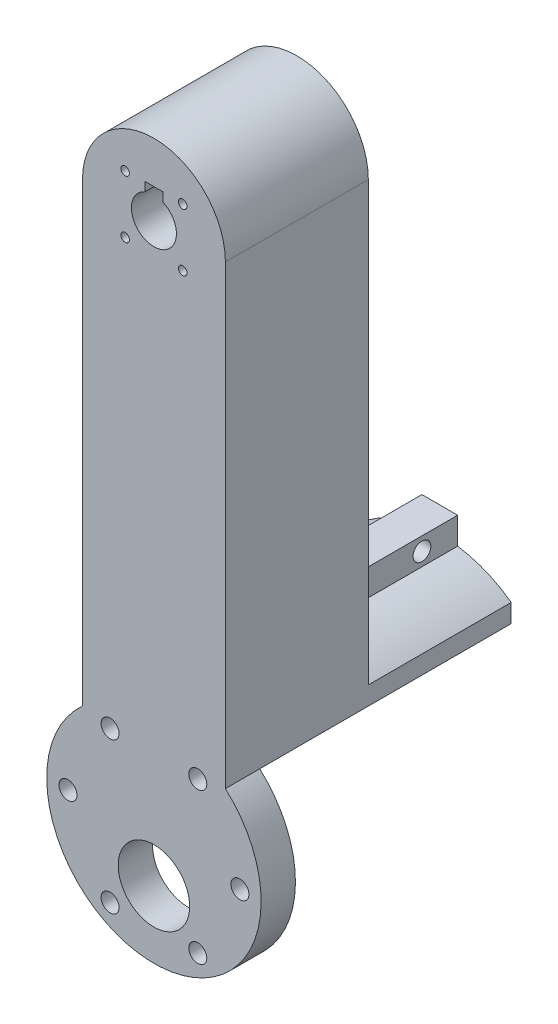
ISO-10303-21;
HEADER;
FILE_DESCRIPTION(('STEP AP214'),'2;1');
FILE_NAME('part.step','',(''),(''),'','','');
FILE_SCHEMA(('AUTOMOTIVE_DESIGN { 1 0 10303 214 1 1 1 1 }'));
ENDSEC;
DATA;
#1=APPLICATION_CONTEXT('core data for automotive mechanical design processes');
#2=APPLICATION_PROTOCOL_DEFINITION('international standard','automotive_design',2000,#1);
#3=PRODUCT_CONTEXT('',#1,'mechanical');
#4=PRODUCT('Part','Part','',(#3));
#5=PRODUCT_RELATED_PRODUCT_CATEGORY('part','',(#4));
#6=PRODUCT_DEFINITION_FORMATION('','',#4);
#7=PRODUCT_DEFINITION_CONTEXT('part definition',#1,'design');
#8=PRODUCT_DEFINITION('design','',#6,#7);
#9=PRODUCT_DEFINITION_SHAPE('','',#8);
#10=(LENGTH_UNIT() NAMED_UNIT(*) SI_UNIT(.MILLI.,.METRE.));
#11=(NAMED_UNIT(*) PLANE_ANGLE_UNIT() SI_UNIT($,.RADIAN.));
#12=(NAMED_UNIT(*) SI_UNIT($,.STERADIAN.) SOLID_ANGLE_UNIT());
#13=UNCERTAINTY_MEASURE_WITH_UNIT(LENGTH_MEASURE(1.E-05),#10,'distance_accuracy_value','');
#14=(GEOMETRIC_REPRESENTATION_CONTEXT(3) GLOBAL_UNCERTAINTY_ASSIGNED_CONTEXT((#13)) GLOBAL_UNIT_ASSIGNED_CONTEXT((#10,
#11,#12)) REPRESENTATION_CONTEXT('',''));
#15=CARTESIAN_POINT('',(0.,0.,0.));
#16=DIRECTION('',(0.,0.,1.));
#17=DIRECTION('',(1.,0.,0.));
#18=AXIS2_PLACEMENT_3D('',#15,#16,#17);
#19=CARTESIAN_POINT('',(0.,-50.8,0.));
#20=DIRECTION('',(0.,0.,-1.));
#21=DIRECTION('',(-1.,0.,0.));
#22=AXIS2_PLACEMENT_3D('',#19,#20,#21);
#23=PLANE('',#22);
#24=DIRECTION('',(0.,-1.,0.));
#25=VECTOR('',#24,1.);
#26=CARTESIAN_POINT('',(1.58749999999998,56.0589906713759,0.));
#27=LINE('',#26,#25);
#28=CARTESIAN_POINT('',(1.58749999999998,56.0589906713759,0.));
#29=VERTEX_POINT('',#28);
#30=CARTESIAN_POINT('',(1.5875,54.4714906713759,0.));
#31=VERTEX_POINT('',#30);
#32=EDGE_CURVE('E199',#29,#31,#27,.T.);
#33=ORIENTED_EDGE('',*,*,#32,.F.);
#34=DIRECTION('',(1.,0.,0.));
#35=VECTOR('',#34,1.);
#36=CARTESIAN_POINT('',(1.58749999999998,56.0589906713759,0.));
#37=LINE('',#36,#35);
#38=CARTESIAN_POINT('',(-1.58750000000002,56.0589906713759,0.));
#39=VERTEX_POINT('',#38);
#40=EDGE_CURVE('E204',#39,#29,#37,.T.);
#41=ORIENTED_EDGE('',*,*,#40,.F.);
#42=DIRECTION('',(0.,1.,0.));
#43=VECTOR('',#42,1.);
#44=CARTESIAN_POINT('',(-1.58750000000002,56.0589906713759,0.));
#45=LINE('',#44,#43);
#46=CARTESIAN_POINT('',(-1.58750000000002,54.4714906713759,0.));
#47=VERTEX_POINT('',#46);
#48=EDGE_CURVE('E212',#47,#39,#45,.T.);
#49=ORIENTED_EDGE('',*,*,#48,.F.);
#50=CARTESIAN_POINT('',(0.,50.8,0.));
#51=DIRECTION('',(0.,0.,1.));
#52=DIRECTION('',(1.,0.,0.));
#53=AXIS2_PLACEMENT_3D('',#50,#51,#52);
#54=CIRCLE('',#53,4.);
#55=EDGE_CURVE('E275',#47,#31,#54,.T.);
#56=ORIENTED_EDGE('',*,*,#55,.T.);
#57=EDGE_LOOP('',(#33,#41,#49,#56));
#58=FACE_BOUND('',#57,.T.);
#59=CARTESIAN_POINT('',(5.11874598900941,45.6812540109906,0.));
#60=DIRECTION('',(0.,0.,1.));
#61=DIRECTION('',(1.,0.,0.));
#62=AXIS2_PLACEMENT_3D('',#59,#60,#61);
#63=CIRCLE('',#62,0.761999999999999);
#64=CARTESIAN_POINT('',(5.88074598900941,45.6812540109906,0.));
#65=VERTEX_POINT('',#64);
#66=EDGE_CURVE('E257',#65,#65,#63,.T.);
#67=ORIENTED_EDGE('',*,*,#66,.T.);
#68=EDGE_LOOP('',(#67));
#69=FACE_BOUND('',#68,.T.);
#70=CARTESIAN_POINT('',(-5.11874598900943,55.9187459890095,0.));
#71=DIRECTION('',(0.,0.,1.));
#72=DIRECTION('',(1.,0.,0.));
#73=AXIS2_PLACEMENT_3D('',#70,#71,#72);
#74=CIRCLE('',#73,0.761999999999999);
#75=CARTESIAN_POINT('',(-4.35674598900943,55.9187459890095,0.));
#76=VERTEX_POINT('',#75);
#77=EDGE_CURVE('E269',#76,#76,#74,.T.);
#78=ORIENTED_EDGE('',*,*,#77,.T.);
#79=EDGE_LOOP('',(#78));
#80=FACE_BOUND('',#79,.T.);
#81=CARTESIAN_POINT('',(5.11874598900941,55.9187459890095,0.));
#82=DIRECTION('',(0.,0.,1.));
#83=DIRECTION('',(1.,0.,0.));
#84=AXIS2_PLACEMENT_3D('',#81,#82,#83);
#85=CIRCLE('',#84,0.761999999999999);
#86=CARTESIAN_POINT('',(5.88074598900941,55.9187459890095,0.));
#87=VERTEX_POINT('',#86);
#88=EDGE_CURVE('E263',#87,#87,#85,.T.);
#89=ORIENTED_EDGE('',*,*,#88,.T.);
#90=EDGE_LOOP('',(#89));
#91=FACE_BOUND('',#90,.T.);
#92=CARTESIAN_POINT('',(-5.11874598900942,45.6812540109906,0.));
#93=DIRECTION('',(0.,0.,1.));
#94=DIRECTION('',(1.,0.,0.));
#95=AXIS2_PLACEMENT_3D('',#92,#93,#94);
#96=CIRCLE('',#95,0.761999999999999);
#97=CARTESIAN_POINT('',(-4.35674598900942,45.6812540109906,0.));
#98=VERTEX_POINT('',#97);
#99=EDGE_CURVE('E253',#98,#98,#96,.T.);
#100=ORIENTED_EDGE('',*,*,#99,.T.);
#101=EDGE_LOOP('',(#100));
#102=FACE_BOUND('',#101,.T.);
#103=DIRECTION('',(1.,0.,0.));
#104=VECTOR('',#103,1.);
#105=CARTESIAN_POINT('',(3.175,-18.3322319145837,0.));
#106=LINE('',#105,#104);
#107=CARTESIAN_POINT('',(-3.175,-18.3322319145837,0.));
#108=VERTEX_POINT('',#107);
#109=CARTESIAN_POINT('',(3.175,-18.3322319145837,0.));
#110=VERTEX_POINT('',#109);
#111=EDGE_CURVE('E341',#108,#110,#106,.T.);
#112=ORIENTED_EDGE('',*,*,#111,.F.);
#113=DIRECTION('',(0.,1.,0.));
#114=VECTOR('',#113,1.);
#115=CARTESIAN_POINT('',(-3.175,-18.3322319145837,0.));
#116=LINE('',#115,#114);
#117=CARTESIAN_POINT('',(-3.175,-23.0947319145837,0.));
#118=VERTEX_POINT('',#117);
#119=EDGE_CURVE('E148',#118,#108,#116,.T.);
#120=ORIENTED_EDGE('',*,*,#119,.F.);
#121=CARTESIAN_POINT('',(0.,-44.45,0.));
#122=DIRECTION('',(0.,0.,-1.));
#123=DIRECTION('',(1.,0.,0.));
#124=AXIS2_PLACEMENT_3D('',#121,#122,#123);
#125=CIRCLE('',#124,21.59);
#126=CARTESIAN_POINT('',(-12.7,-26.9903866022182,0.));
#127=VERTEX_POINT('',#126);
#128=EDGE_CURVE('E56',#127,#118,#125,.T.);
#129=ORIENTED_EDGE('',*,*,#128,.F.);
#130=DIRECTION('',(0.,-1.,0.));
#131=VECTOR('',#130,1.);
#132=CARTESIAN_POINT('',(-12.7,50.8,0.));
#133=LINE('',#132,#131);
#134=CARTESIAN_POINT('',(-12.7,50.8,0.));
#135=VERTEX_POINT('',#134);
#136=EDGE_CURVE('E286',#135,#127,#133,.T.);
#137=ORIENTED_EDGE('',*,*,#136,.F.);
#138=CARTESIAN_POINT('',(0.,50.8,0.));
#139=DIRECTION('',(0.,0.,1.));
#140=DIRECTION('',(-1.,0.,0.));
#141=AXIS2_PLACEMENT_3D('',#138,#139,#140);
#142=CIRCLE('',#141,12.7);
#143=CARTESIAN_POINT('',(12.7,50.8,0.));
#144=VERTEX_POINT('',#143);
#145=EDGE_CURVE('E293',#144,#135,#142,.T.);
#146=ORIENTED_EDGE('',*,*,#145,.F.);
#147=DIRECTION('',(0.,1.,0.));
#148=VECTOR('',#147,1.);
#149=CARTESIAN_POINT('',(12.7,50.8,0.));
#150=LINE('',#149,#148);
#151=CARTESIAN_POINT('',(12.7,-26.9903866022182,0.));
#152=VERTEX_POINT('',#151);
#153=EDGE_CURVE('E162',#152,#144,#150,.T.);
#154=ORIENTED_EDGE('',*,*,#153,.F.);
#155=CARTESIAN_POINT('',(3.175,-23.0947319145837,0.));
#156=VERTEX_POINT('',#155);
#157=EDGE_CURVE('E155',#156,#152,#125,.T.);
#158=ORIENTED_EDGE('',*,*,#157,.F.);
#159=DIRECTION('',(0.,-1.,0.));
#160=VECTOR('',#159,1.);
#161=CARTESIAN_POINT('',(3.175,-18.3322319145837,0.));
#162=LINE('',#161,#160);
#163=EDGE_CURVE('E141',#110,#156,#162,.T.);
#164=ORIENTED_EDGE('',*,*,#163,.F.);
#165=EDGE_LOOP('',(#112,#120,#129,#137,#146,#154,#158,#164));
#166=FACE_BOUND('',#165,.T.);
#167=ADVANCED_FACE('F32',(#58,#69,#80,#91,#102,#166),#23,.T.);
#168=CARTESIAN_POINT('',(0.,-44.45,-25.4));
#169=DIRECTION('',(0.,0.,1.));
#170=DIRECTION('',(1.,0.,0.));
#171=AXIS2_PLACEMENT_3D('',#168,#169,#170);
#172=CYLINDRICAL_SURFACE('',#171,21.59);
#173=DIRECTION('',(0.,0.,1.));
#174=VECTOR('',#173,1.);
#175=CARTESIAN_POINT('',(-3.175,-23.0947319145837,-33.3375));
#176=LINE('',#175,#174);
#177=CARTESIAN_POINT('',(-3.175,-23.0947319145837,-25.4));
#178=VERTEX_POINT('',#177);
#179=EDGE_CURVE('E159',#178,#118,#176,.T.);
#180=ORIENTED_EDGE('',*,*,#179,.F.);
#181=CARTESIAN_POINT('',(0.,-44.45,-25.4));
#182=DIRECTION('',(0.,0.,-1.));
#183=DIRECTION('',(1.,0.,0.));
#184=AXIS2_PLACEMENT_3D('',#181,#182,#183);
#185=CIRCLE('',#184,21.59);
#186=CARTESIAN_POINT('',(-12.7,-26.9903866022182,-25.4));
#187=VERTEX_POINT('',#186);
#188=EDGE_CURVE('E328',#187,#178,#185,.T.);
#189=ORIENTED_EDGE('',*,*,#188,.F.);
#190=DIRECTION('',(0.,0.,1.));
#191=VECTOR('',#190,1.);
#192=CARTESIAN_POINT('',(-12.7,-26.9903866022182,-25.4));
#193=LINE('',#192,#191);
#194=EDGE_CURVE('E175',#187,#127,#193,.T.);
#195=ORIENTED_EDGE('',*,*,#194,.T.);
#196=ORIENTED_EDGE('',*,*,#128,.T.);
#197=EDGE_LOOP('',(#180,#189,#195,#196));
#198=FACE_BOUND('',#197,.T.);
#199=ADVANCED_FACE('F326',(#198),#172,.T.);
#200=DIRECTION('',(0.,0.,1.));
#201=VECTOR('',#200,1.);
#202=CARTESIAN_POINT('',(3.175,-23.0947319145837,-33.3375));
#203=LINE('',#202,#201);
#204=CARTESIAN_POINT('',(3.175,-23.0947319145837,-25.4));
#205=VERTEX_POINT('',#204);
#206=EDGE_CURVE('E48',#205,#156,#203,.T.);
#207=ORIENTED_EDGE('',*,*,#206,.T.);
#208=ORIENTED_EDGE('',*,*,#157,.T.);
#209=DIRECTION('',(0.,0.,1.));
#210=VECTOR('',#209,1.);
#211=CARTESIAN_POINT('',(12.7,-26.9903866022182,-25.4));
#212=LINE('',#211,#210);
#213=CARTESIAN_POINT('',(12.7,-26.9903866022182,-25.4));
#214=VERTEX_POINT('',#213);
#215=EDGE_CURVE('E173',#214,#152,#212,.T.);
#216=ORIENTED_EDGE('',*,*,#215,.F.);
#217=EDGE_CURVE('E157',#205,#214,#185,.T.);
#218=ORIENTED_EDGE('',*,*,#217,.F.);
#219=EDGE_LOOP('',(#207,#208,#216,#218));
#220=FACE_BOUND('',#219,.T.);
#221=ADVANCED_FACE('F153',(#220),#172,.T.);
#222=CARTESIAN_POINT('',(0.,-44.45,25.4));
#223=DIRECTION('',(0.,0.,-1.));
#224=DIRECTION('',(-1.,0.,0.));
#225=AXIS2_PLACEMENT_3D('',#222,#223,#224);
#226=CYLINDRICAL_SURFACE('',#225,19.05);
#227=DIRECTION('',(0.,0.,-1.));
#228=VECTOR('',#227,1.);
#229=CARTESIAN_POINT('',(-12.7,-30.2509683428763,25.4));
#230=LINE('',#229,#228);
#231=CARTESIAN_POINT('',(-12.7,-30.2509683428763,19.3));
#232=VERTEX_POINT('',#231);
#233=CARTESIAN_POINT('',(-12.7,-30.2509683428763,25.4));
#234=VERTEX_POINT('',#233);
#235=EDGE_CURVE('E41',#232,#234,#230,.F.);
#236=ORIENTED_EDGE('',*,*,#235,.F.);
#237=CARTESIAN_POINT('',(0.,-44.45,19.3));
#238=DIRECTION('',(0.,0.,-1.));
#239=DIRECTION('',(-1.,0.,0.));
#240=AXIS2_PLACEMENT_3D('',#237,#238,#239);
#241=CIRCLE('',#240,19.05);
#242=CARTESIAN_POINT('',(12.7,-30.2509683428763,19.3));
#243=VERTEX_POINT('',#242);
#244=EDGE_CURVE('E178',#243,#232,#241,.T.);
#245=ORIENTED_EDGE('',*,*,#244,.F.);
#246=DIRECTION('',(0.,0.,-1.));
#247=VECTOR('',#246,1.);
#248=CARTESIAN_POINT('',(12.7,-30.2509683428763,25.4));
#249=LINE('',#248,#247);
#250=CARTESIAN_POINT('',(12.7,-30.2509683428763,25.4));
#251=VERTEX_POINT('',#250);
#252=EDGE_CURVE('E250',#251,#243,#249,.T.);
#253=ORIENTED_EDGE('',*,*,#252,.F.);
#254=CARTESIAN_POINT('',(0.,-44.45,25.4));
#255=DIRECTION('',(0.,0.,-1.));
#256=DIRECTION('',(-1.,0.,0.));
#257=AXIS2_PLACEMENT_3D('',#254,#255,#256);
#258=CIRCLE('',#257,19.05);
#259=EDGE_CURVE('E246',#251,#234,#258,.T.);
#260=ORIENTED_EDGE('',*,*,#259,.T.);
#261=EDGE_LOOP('',(#236,#245,#253,#260));
#262=FACE_BOUND('',#261,.T.);
#263=ADVANCED_FACE('F316',(#262),#226,.T.);
#264=CARTESIAN_POINT('',(0.,-51.562,0.));
#265=DIRECTION('',(0.,0.,1.));
#266=DIRECTION('',(1.,0.,0.));
#267=AXIS2_PLACEMENT_3D('',#264,#265,#266);
#268=CYLINDRICAL_SURFACE('',#267,6.35);
#269=CARTESIAN_POINT('',(0.,-51.562,25.4));
#270=DIRECTION('',(0.,0.,1.));
#271=DIRECTION('',(1.,0.,0.));
#272=AXIS2_PLACEMENT_3D('',#269,#270,#271);
#273=CIRCLE('',#272,6.35);
#274=CARTESIAN_POINT('',(6.35,-51.562,25.4));
#275=VERTEX_POINT('',#274);
#276=EDGE_CURVE('E243',#275,#275,#273,.T.);
#277=ORIENTED_EDGE('',*,*,#276,.T.);
#278=EDGE_LOOP('',(#277));
#279=FACE_BOUND('',#278,.T.);
#280=CARTESIAN_POINT('',(0.,-51.562,19.3));
#281=DIRECTION('',(0.,0.,-1.));
#282=DIRECTION('',(-1.,0.,0.));
#283=AXIS2_PLACEMENT_3D('',#280,#281,#282);
#284=CIRCLE('',#283,6.35);
#285=CARTESIAN_POINT('',(-6.35,-51.562,19.3));
#286=VERTEX_POINT('',#285);
#287=EDGE_CURVE('E196',#286,#286,#284,.F.);
#288=ORIENTED_EDGE('',*,*,#287,.F.);
#289=EDGE_LOOP('',(#288));
#290=FACE_BOUND('',#289,.T.);
#291=ADVANCED_FACE('F405',(#279,#290),#268,.F.);
#292=CARTESIAN_POINT('',(-7.79422931497099,-31.2359034631993,0.));
#293=DIRECTION('',(0.,0.,1.));
#294=DIRECTION('',(1.,0.,0.));
#295=AXIS2_PLACEMENT_3D('',#292,#293,#294);
#296=CYLINDRICAL_SURFACE('',#295,1.60000000000644);
#297=CARTESIAN_POINT('',(-7.79422931497099,-31.2359034631993,25.4));
#298=DIRECTION('',(0.,0.,1.));
#299=DIRECTION('',(1.,0.,0.));
#300=AXIS2_PLACEMENT_3D('',#297,#298,#299);
#301=CIRCLE('',#300,1.60000000000644);
#302=CARTESIAN_POINT('',(-6.19422931496456,-31.2359034631993,25.4));
#303=VERTEX_POINT('',#302);
#304=EDGE_CURVE('E238',#303,#303,#301,.T.);
#305=ORIENTED_EDGE('',*,*,#304,.T.);
#306=EDGE_LOOP('',(#305));
#307=FACE_BOUND('',#306,.T.);
#308=CARTESIAN_POINT('',(-7.79422931497099,-31.2359034631993,19.3));
#309=DIRECTION('',(0.,0.,-1.));
#310=DIRECTION('',(-1.,0.,0.));
#311=AXIS2_PLACEMENT_3D('',#308,#309,#310);
#312=CIRCLE('',#311,1.60000000000644);
#313=CARTESIAN_POINT('',(-9.39422931497743,-31.2359034631993,19.3));
#314=VERTEX_POINT('',#313);
#315=EDGE_CURVE('E193',#314,#314,#312,.F.);
#316=ORIENTED_EDGE('',*,*,#315,.F.);
#317=EDGE_LOOP('',(#316));
#318=FACE_BOUND('',#317,.T.);
#319=ADVANCED_FACE('F407',(#307,#318),#296,.F.);
#320=CARTESIAN_POINT('',(7.79422931495573,-58.0175408579343,0.));
#321=DIRECTION('',(0.,0.,1.));
#322=DIRECTION('',(1.,0.,0.));
#323=AXIS2_PLACEMENT_3D('',#320,#321,#322);
#324=CYLINDRICAL_SURFACE('',#323,1.60000000000637);
#325=CARTESIAN_POINT('',(7.79422931495573,-58.0175408579343,25.4));
#326=DIRECTION('',(0.,0.,1.));
#327=DIRECTION('',(1.,0.,0.));
#328=AXIS2_PLACEMENT_3D('',#325,#326,#327);
#329=CIRCLE('',#328,1.60000000000637);
#330=CARTESIAN_POINT('',(9.3942293149621,-58.0175408579343,25.4));
#331=VERTEX_POINT('',#330);
#332=EDGE_CURVE('E219',#331,#331,#329,.T.);
#333=ORIENTED_EDGE('',*,*,#332,.T.);
#334=EDGE_LOOP('',(#333));
#335=FACE_BOUND('',#334,.T.);
#336=CARTESIAN_POINT('',(7.79422931495573,-58.0175408579343,19.3));
#337=DIRECTION('',(0.,0.,-1.));
#338=DIRECTION('',(-1.,0.,0.));
#339=AXIS2_PLACEMENT_3D('',#336,#337,#338);
#340=CIRCLE('',#339,1.60000000000637);
#341=CARTESIAN_POINT('',(6.19422931494936,-58.0175408579343,19.3));
#342=VERTEX_POINT('',#341);
#343=EDGE_CURVE('E190',#342,#342,#340,.F.);
#344=ORIENTED_EDGE('',*,*,#343,.F.);
#345=EDGE_LOOP('',(#344));
#346=FACE_BOUND('',#345,.T.);
#347=ADVANCED_FACE('F414',(#335,#346),#324,.F.);
#348=CARTESIAN_POINT('',(-15.2766000000076,-44.4500000000005,0.));
#349=DIRECTION('',(0.,0.,1.));
#350=DIRECTION('',(1.,0.,0.));
#351=AXIS2_PLACEMENT_3D('',#348,#349,#350);
#352=CYLINDRICAL_SURFACE('',#351,1.60000000000642);
#353=CARTESIAN_POINT('',(-15.2766000000076,-44.4500000000005,25.4));
#354=DIRECTION('',(0.,0.,1.));
#355=DIRECTION('',(1.,0.,0.));
#356=AXIS2_PLACEMENT_3D('',#353,#354,#355);
#357=CIRCLE('',#356,1.60000000000642);
#358=CARTESIAN_POINT('',(-13.6766000000012,-44.4500000000005,25.4));
#359=VERTEX_POINT('',#358);
#360=EDGE_CURVE('E235',#359,#359,#357,.T.);
#361=ORIENTED_EDGE('',*,*,#360,.T.);
#362=EDGE_LOOP('',(#361));
#363=FACE_BOUND('',#362,.T.);
#364=CARTESIAN_POINT('',(-15.2766000000076,-44.4500000000005,19.3));
#365=DIRECTION('',(0.,0.,-1.));
#366=DIRECTION('',(-1.,0.,0.));
#367=AXIS2_PLACEMENT_3D('',#364,#365,#366);
#368=CIRCLE('',#367,1.60000000000642);
#369=CARTESIAN_POINT('',(-16.8766000000141,-44.4500000000005,19.3));
#370=VERTEX_POINT('',#369);
#371=EDGE_CURVE('E187',#370,#370,#368,.F.);
#372=ORIENTED_EDGE('',*,*,#371,.F.);
#373=EDGE_LOOP('',(#372));
#374=FACE_BOUND('',#373,.T.);
#375=ADVANCED_FACE('F464',(#363,#374),#352,.F.);
#376=CARTESIAN_POINT('',(15.2765999999924,-44.4500000000004,0.));
#377=DIRECTION('',(0.,0.,1.));
#378=DIRECTION('',(1.,0.,0.));
#379=AXIS2_PLACEMENT_3D('',#376,#377,#378);
#380=CYLINDRICAL_SURFACE('',#379,1.60000000000639);
#381=CARTESIAN_POINT('',(15.2765999999924,-44.4500000000004,25.4));
#382=DIRECTION('',(0.,0.,1.));
#383=DIRECTION('',(1.,0.,0.));
#384=AXIS2_PLACEMENT_3D('',#381,#382,#383);
#385=CIRCLE('',#384,1.60000000000639);
#386=CARTESIAN_POINT('',(16.8765999999988,-44.4500000000004,25.4));
#387=VERTEX_POINT('',#386);
#388=EDGE_CURVE('E232',#387,#387,#385,.T.);
#389=ORIENTED_EDGE('',*,*,#388,.T.);
#390=EDGE_LOOP('',(#389));
#391=FACE_BOUND('',#390,.T.);
#392=CARTESIAN_POINT('',(15.2765999999924,-44.4500000000004,19.3));
#393=DIRECTION('',(0.,0.,-1.));
#394=DIRECTION('',(-1.,0.,0.));
#395=AXIS2_PLACEMENT_3D('',#392,#393,#394);
#396=CIRCLE('',#395,1.60000000000639);
#397=CARTESIAN_POINT('',(13.676599999986,-44.4500000000004,19.3));
#398=VERTEX_POINT('',#397);
#399=EDGE_CURVE('E184',#398,#398,#396,.F.);
#400=ORIENTED_EDGE('',*,*,#399,.F.);
#401=EDGE_LOOP('',(#400));
#402=FACE_BOUND('',#401,.T.);
#403=ADVANCED_FACE('F469',(#391,#402),#380,.F.);
#404=CARTESIAN_POINT('',(-7.79422931497093,-58.0175408579343,0.));
#405=DIRECTION('',(0.,0.,1.));
#406=DIRECTION('',(1.,0.,0.));
#407=AXIS2_PLACEMENT_3D('',#404,#405,#406);
#408=CYLINDRICAL_SURFACE('',#407,1.60000000000637);
#409=CARTESIAN_POINT('',(-7.79422931497093,-58.0175408579343,25.4));
#410=DIRECTION('',(0.,0.,1.));
#411=DIRECTION('',(1.,0.,0.));
#412=AXIS2_PLACEMENT_3D('',#409,#410,#411);
#413=CIRCLE('',#412,1.60000000000637);
#414=CARTESIAN_POINT('',(-6.19422931496456,-58.0175408579343,25.4));
#415=VERTEX_POINT('',#414);
#416=EDGE_CURVE('E229',#415,#415,#413,.T.);
#417=ORIENTED_EDGE('',*,*,#416,.T.);
#418=EDGE_LOOP('',(#417));
#419=FACE_BOUND('',#418,.T.);
#420=CARTESIAN_POINT('',(-7.79422931497093,-58.0175408579343,19.3));
#421=DIRECTION('',(0.,0.,-1.));
#422=DIRECTION('',(-1.,0.,0.));
#423=AXIS2_PLACEMENT_3D('',#420,#421,#422);
#424=CIRCLE('',#423,1.60000000000637);
#425=CARTESIAN_POINT('',(-9.39422931497731,-58.0175408579343,19.3));
#426=VERTEX_POINT('',#425);
#427=EDGE_CURVE('E181',#426,#426,#424,.F.);
#428=ORIENTED_EDGE('',*,*,#427,.F.);
#429=EDGE_LOOP('',(#428));
#430=FACE_BOUND('',#429,.T.);
#431=ADVANCED_FACE('F444',(#419,#430),#408,.F.);
#432=CARTESIAN_POINT('',(7.79422931495566,-31.2359034631993,0.));
#433=DIRECTION('',(0.,0.,1.));
#434=DIRECTION('',(1.,0.,0.));
#435=AXIS2_PLACEMENT_3D('',#432,#433,#434);
#436=CYLINDRICAL_SURFACE('',#435,1.60000000000643);
#437=CARTESIAN_POINT('',(7.79422931495566,-31.2359034631993,25.4));
#438=DIRECTION('',(0.,0.,1.));
#439=DIRECTION('',(1.,0.,0.));
#440=AXIS2_PLACEMENT_3D('',#437,#438,#439);
#441=CIRCLE('',#440,1.60000000000643);
#442=CARTESIAN_POINT('',(9.39422931496209,-31.2359034631993,25.4));
#443=VERTEX_POINT('',#442);
#444=EDGE_CURVE('E228',#443,#443,#441,.T.);
#445=ORIENTED_EDGE('',*,*,#444,.T.);
#446=EDGE_LOOP('',(#445));
#447=FACE_BOUND('',#446,.T.);
#448=CARTESIAN_POINT('',(7.79422931495566,-31.2359034631993,19.3));
#449=DIRECTION('',(0.,0.,-1.));
#450=DIRECTION('',(-1.,0.,0.));
#451=AXIS2_PLACEMENT_3D('',#448,#449,#450);
#452=CIRCLE('',#451,1.60000000000643);
#453=CARTESIAN_POINT('',(6.19422931494923,-31.2359034631993,19.3));
#454=VERTEX_POINT('',#453);
#455=EDGE_CURVE('E36',#454,#454,#452,.F.);
#456=ORIENTED_EDGE('',*,*,#455,.F.);
#457=EDGE_LOOP('',(#456));
#458=FACE_BOUND('',#457,.T.);
#459=ADVANCED_FACE('F439',(#447,#458),#436,.F.);
#460=CARTESIAN_POINT('',(0.,-50.8,25.4));
#461=DIRECTION('',(0.,0.,-1.));
#462=DIRECTION('',(-1.,0.,0.));
#463=AXIS2_PLACEMENT_3D('',#460,#461,#462);
#464=PLANE('',#463);
#465=ORIENTED_EDGE('',*,*,#444,.F.);
#466=EDGE_LOOP('',(#465));
#467=FACE_BOUND('',#466,.T.);
#468=ORIENTED_EDGE('',*,*,#416,.F.);
#469=EDGE_LOOP('',(#468));
#470=FACE_BOUND('',#469,.T.);
#471=ORIENTED_EDGE('',*,*,#388,.F.);
#472=EDGE_LOOP('',(#471));
#473=FACE_BOUND('',#472,.T.);
#474=ORIENTED_EDGE('',*,*,#360,.F.);
#475=EDGE_LOOP('',(#474));
#476=FACE_BOUND('',#475,.T.);
#477=ORIENTED_EDGE('',*,*,#332,.F.);
#478=EDGE_LOOP('',(#477));
#479=FACE_BOUND('',#478,.T.);
#480=ORIENTED_EDGE('',*,*,#304,.F.);
#481=EDGE_LOOP('',(#480));
#482=FACE_BOUND('',#481,.T.);
#483=ORIENTED_EDGE('',*,*,#276,.F.);
#484=EDGE_LOOP('',(#483));
#485=FACE_BOUND('',#484,.T.);
#486=DIRECTION('',(0.,-1.,0.));
#487=VECTOR('',#486,1.);
#488=CARTESIAN_POINT('',(-12.7,50.8,25.4));
#489=LINE('',#488,#487);
#490=CARTESIAN_POINT('',(-12.7,50.8,25.4));
#491=VERTEX_POINT('',#490);
#492=EDGE_CURVE('E288',#491,#234,#489,.T.);
#493=ORIENTED_EDGE('',*,*,#492,.T.);
#494=ORIENTED_EDGE('',*,*,#259,.F.);
#495=DIRECTION('',(0.,1.,0.));
#496=VECTOR('',#495,1.);
#497=CARTESIAN_POINT('',(12.7,50.8,25.4));
#498=LINE('',#497,#496);
#499=CARTESIAN_POINT('',(12.7,50.8,25.4));
#500=VERTEX_POINT('',#499);
#501=EDGE_CURVE('E283',#251,#500,#498,.T.);
#502=ORIENTED_EDGE('',*,*,#501,.T.);
#503=CARTESIAN_POINT('',(0.,50.8,25.4));
#504=DIRECTION('',(0.,0.,1.));
#505=DIRECTION('',(-1.,0.,0.));
#506=AXIS2_PLACEMENT_3D('',#503,#504,#505);
#507=CIRCLE('',#506,12.7);
#508=EDGE_CURVE('E285',#500,#491,#507,.T.);
#509=ORIENTED_EDGE('',*,*,#508,.T.);
#510=EDGE_LOOP('',(#493,#494,#502,#509));
#511=FACE_BOUND('',#510,.T.);
#512=DIRECTION('',(1.,0.,0.));
#513=VECTOR('',#512,1.);
#514=CARTESIAN_POINT('',(1.58749999999998,56.0589906713759,25.4));
#515=LINE('',#514,#513);
#516=CARTESIAN_POINT('',(-1.58750000000002,56.0589906713759,25.4));
#517=VERTEX_POINT('',#516);
#518=CARTESIAN_POINT('',(1.58749999999998,56.0589906713759,25.4));
#519=VERTEX_POINT('',#518);
#520=EDGE_CURVE('E207',#517,#519,#515,.T.);
#521=ORIENTED_EDGE('',*,*,#520,.T.);
#522=DIRECTION('',(0.,-1.,0.));
#523=VECTOR('',#522,1.);
#524=CARTESIAN_POINT('',(1.58749999999998,56.0589906713759,25.4));
#525=LINE('',#524,#523);
#526=CARTESIAN_POINT('',(1.58750000000002,54.4714906713759,25.4));
#527=VERTEX_POINT('',#526);
#528=EDGE_CURVE('E200',#519,#527,#525,.T.);
#529=ORIENTED_EDGE('',*,*,#528,.T.);
#530=CARTESIAN_POINT('',(0.,50.8,25.4));
#531=DIRECTION('',(0.,0.,1.));
#532=DIRECTION('',(1.,0.,0.));
#533=AXIS2_PLACEMENT_3D('',#530,#531,#532);
#534=CIRCLE('',#533,4.);
#535=CARTESIAN_POINT('',(-1.58750000000002,54.4714906713759,25.4));
#536=VERTEX_POINT('',#535);
#537=EDGE_CURVE('E278',#536,#527,#534,.T.);
#538=ORIENTED_EDGE('',*,*,#537,.F.);
#539=DIRECTION('',(0.,1.,0.));
#540=VECTOR('',#539,1.);
#541=CARTESIAN_POINT('',(-1.58750000000002,56.0589906713759,25.4));
#542=LINE('',#541,#540);
#543=EDGE_CURVE('E203',#536,#517,#542,.T.);
#544=ORIENTED_EDGE('',*,*,#543,.T.);
#545=EDGE_LOOP('',(#521,#529,#538,#544));
#546=FACE_BOUND('',#545,.T.);
#547=CARTESIAN_POINT('',(-5.11874598900943,55.9187459890095,25.4));
#548=DIRECTION('',(0.,0.,1.));
#549=DIRECTION('',(1.,0.,0.));
#550=AXIS2_PLACEMENT_3D('',#547,#548,#549);
#551=CIRCLE('',#550,0.761999999999999);
#552=CARTESIAN_POINT('',(-4.35674598900943,55.9187459890095,25.4));
#553=VERTEX_POINT('',#552);
#554=EDGE_CURVE('E272',#553,#553,#551,.T.);
#555=ORIENTED_EDGE('',*,*,#554,.F.);
#556=EDGE_LOOP('',(#555));
#557=FACE_BOUND('',#556,.T.);
#558=CARTESIAN_POINT('',(5.11874598900941,55.9187459890095,25.4));
#559=DIRECTION('',(0.,0.,1.));
#560=DIRECTION('',(1.,0.,0.));
#561=AXIS2_PLACEMENT_3D('',#558,#559,#560);
#562=CIRCLE('',#561,0.761999999999999);
#563=CARTESIAN_POINT('',(5.88074598900941,55.9187459890095,25.4));
#564=VERTEX_POINT('',#563);
#565=EDGE_CURVE('E266',#564,#564,#562,.T.);
#566=ORIENTED_EDGE('',*,*,#565,.F.);
#567=EDGE_LOOP('',(#566));
#568=FACE_BOUND('',#567,.T.);
#569=CARTESIAN_POINT('',(5.11874598900941,45.6812540109906,25.4));
#570=DIRECTION('',(0.,0.,1.));
#571=DIRECTION('',(1.,0.,0.));
#572=AXIS2_PLACEMENT_3D('',#569,#570,#571);
#573=CIRCLE('',#572,0.761999999999999);
#574=CARTESIAN_POINT('',(5.88074598900941,45.6812540109906,25.4));
#575=VERTEX_POINT('',#574);
#576=EDGE_CURVE('E260',#575,#575,#573,.T.);
#577=ORIENTED_EDGE('',*,*,#576,.F.);
#578=EDGE_LOOP('',(#577));
#579=FACE_BOUND('',#578,.T.);
#580=CARTESIAN_POINT('',(-5.11874598900942,45.6812540109906,25.4));
#581=DIRECTION('',(0.,0.,1.));
#582=DIRECTION('',(1.,0.,0.));
#583=AXIS2_PLACEMENT_3D('',#580,#581,#582);
#584=CIRCLE('',#583,0.761999999999999);
#585=CARTESIAN_POINT('',(-4.35674598900942,45.6812540109906,25.4));
#586=VERTEX_POINT('',#585);
#587=EDGE_CURVE('E254',#586,#586,#584,.T.);
#588=ORIENTED_EDGE('',*,*,#587,.F.);
#589=EDGE_LOOP('',(#588));
#590=FACE_BOUND('',#589,.T.);
#591=ADVANCED_FACE('F311',(#467,#470,#473,#476,#479,#482,#485,#511,#546,#557,#568,#579,#590),
#464,.F.);
#592=CARTESIAN_POINT('',(12.7,50.8,25.4));
#593=DIRECTION('',(-1.,0.,0.));
#594=DIRECTION('',(0.,-1.,0.));
#595=AXIS2_PLACEMENT_3D('',#592,#593,#594);
#596=PLANE('',#595);
#597=ORIENTED_EDGE('',*,*,#501,.F.);
#598=ORIENTED_EDGE('',*,*,#252,.T.);
#599=CARTESIAN_POINT('',(12.7,-30.2509683428763,-25.4));
#600=VERTEX_POINT('',#599);
#601=EDGE_CURVE('E249',#243,#600,#249,.T.);
#602=ORIENTED_EDGE('',*,*,#601,.T.);
#603=DIRECTION('',(0.,-1.,0.));
#604=VECTOR('',#603,1.);
#605=CARTESIAN_POINT('',(12.7,-30.2509683428763,-25.4));
#606=LINE('',#605,#604);
#607=EDGE_CURVE('E171',#214,#600,#606,.T.);
#608=ORIENTED_EDGE('',*,*,#607,.F.);
#609=ORIENTED_EDGE('',*,*,#215,.T.);
#610=ORIENTED_EDGE('',*,*,#153,.T.);
#611=DIRECTION('',(0.,0.,-1.));
#612=VECTOR('',#611,1.);
#613=CARTESIAN_POINT('',(12.7,50.8,25.4));
#614=LINE('',#613,#612);
#615=EDGE_CURVE('E298',#500,#144,#614,.T.);
#616=ORIENTED_EDGE('',*,*,#615,.F.);
#617=EDGE_LOOP('',(#597,#598,#602,#608,#609,#610,#616));
#618=FACE_BOUND('',#617,.T.);
#619=ADVANCED_FACE('F34',(#618),#596,.F.);
#620=CARTESIAN_POINT('',(0.,50.8,25.4));
#621=DIRECTION('',(0.,0.,-1.));
#622=DIRECTION('',(-1.,0.,0.));
#623=AXIS2_PLACEMENT_3D('',#620,#621,#622);
#624=CYLINDRICAL_SURFACE('',#623,12.7);
#625=ORIENTED_EDGE('',*,*,#145,.T.);
#626=DIRECTION('',(0.,0.,-1.));
#627=VECTOR('',#626,1.);
#628=CARTESIAN_POINT('',(-12.7,50.8,25.4));
#629=LINE('',#628,#627);
#630=EDGE_CURVE('E291',#491,#135,#629,.T.);
#631=ORIENTED_EDGE('',*,*,#630,.F.);
#632=ORIENTED_EDGE('',*,*,#508,.F.);
#633=ORIENTED_EDGE('',*,*,#615,.T.);
#634=EDGE_LOOP('',(#625,#631,#632,#633));
#635=FACE_BOUND('',#634,.T.);
#636=ADVANCED_FACE('F321',(#635),#624,.T.);
#637=CARTESIAN_POINT('',(-12.7,50.8,25.4));
#638=DIRECTION('',(1.,0.,0.));
#639=DIRECTION('',(0.,1.,0.));
#640=AXIS2_PLACEMENT_3D('',#637,#638,#639);
#641=PLANE('',#640);
#642=ORIENTED_EDGE('',*,*,#136,.T.);
#643=ORIENTED_EDGE('',*,*,#194,.F.);
#644=DIRECTION('',(0.,1.,0.));
#645=VECTOR('',#644,1.);
#646=CARTESIAN_POINT('',(-12.7,-30.2509683428763,-25.4));
#647=LINE('',#646,#645);
#648=CARTESIAN_POINT('',(-12.7,-30.2509683428763,-25.4));
#649=VERTEX_POINT('',#648);
#650=EDGE_CURVE('E330',#649,#187,#647,.T.);
#651=ORIENTED_EDGE('',*,*,#650,.F.);
#652=EDGE_CURVE('E11',#649,#232,#230,.F.);
#653=ORIENTED_EDGE('',*,*,#652,.T.);
#654=ORIENTED_EDGE('',*,*,#235,.T.);
#655=ORIENTED_EDGE('',*,*,#492,.F.);
#656=ORIENTED_EDGE('',*,*,#630,.T.);
#657=EDGE_LOOP('',(#642,#643,#651,#653,#654,#655,#656));
#658=FACE_BOUND('',#657,.T.);
#659=ADVANCED_FACE('F306',(#658),#641,.F.);
#660=CARTESIAN_POINT('',(0.,50.8,25.4));
#661=DIRECTION('',(0.,0.,-1.));
#662=DIRECTION('',(-1.,0.,0.));
#663=AXIS2_PLACEMENT_3D('',#660,#661,#662);
#664=CYLINDRICAL_SURFACE('',#663,4.);
#665=DIRECTION('',(0.,0.,-1.));
#666=VECTOR('',#665,1.);
#667=CARTESIAN_POINT('',(-1.58750000000002,54.4714906713759,25.4));
#668=LINE('',#667,#666);
#669=EDGE_CURVE('E222',#536,#47,#668,.T.);
#670=ORIENTED_EDGE('',*,*,#669,.F.);
#671=ORIENTED_EDGE('',*,*,#537,.T.);
#672=DIRECTION('',(0.,0.,-1.));
#673=VECTOR('',#672,1.);
#674=CARTESIAN_POINT('',(1.58750000000002,54.4714906713759,25.4));
#675=LINE('',#674,#673);
#676=EDGE_CURVE('E210',#527,#31,#675,.T.);
#677=ORIENTED_EDGE('',*,*,#676,.T.);
#678=ORIENTED_EDGE('',*,*,#55,.F.);
#679=EDGE_LOOP('',(#670,#671,#677,#678));
#680=FACE_BOUND('',#679,.T.);
#681=ADVANCED_FACE('F431',(#680),#664,.F.);
#682=CARTESIAN_POINT('',(-5.11874598900943,55.9187459890095,25.4));
#683=DIRECTION('',(0.,0.,-1.));
#684=DIRECTION('',(-1.,0.,0.));
#685=AXIS2_PLACEMENT_3D('',#682,#683,#684);
#686=CYLINDRICAL_SURFACE('',#685,0.761999999999999);
#687=ORIENTED_EDGE('',*,*,#554,.T.);
#688=EDGE_LOOP('',(#687));
#689=FACE_BOUND('',#688,.T.);
#690=ORIENTED_EDGE('',*,*,#77,.F.);
#691=EDGE_LOOP('',(#690));
#692=FACE_BOUND('',#691,.T.);
#693=ADVANCED_FACE('F625',(#689,#692),#686,.F.);
#694=CARTESIAN_POINT('',(5.11874598900941,55.9187459890095,25.4));
#695=DIRECTION('',(0.,0.,-1.));
#696=DIRECTION('',(-1.,0.,0.));
#697=AXIS2_PLACEMENT_3D('',#694,#695,#696);
#698=CYLINDRICAL_SURFACE('',#697,0.761999999999999);
#699=ORIENTED_EDGE('',*,*,#565,.T.);
#700=EDGE_LOOP('',(#699));
#701=FACE_BOUND('',#700,.T.);
#702=ORIENTED_EDGE('',*,*,#88,.F.);
#703=EDGE_LOOP('',(#702));
#704=FACE_BOUND('',#703,.T.);
#705=ADVANCED_FACE('F618',(#701,#704),#698,.F.);
#706=CARTESIAN_POINT('',(5.11874598900941,45.6812540109906,25.4));
#707=DIRECTION('',(0.,0.,-1.));
#708=DIRECTION('',(-1.,0.,0.));
#709=AXIS2_PLACEMENT_3D('',#706,#707,#708);
#710=CYLINDRICAL_SURFACE('',#709,0.761999999999999);
#711=ORIENTED_EDGE('',*,*,#576,.T.);
#712=EDGE_LOOP('',(#711));
#713=FACE_BOUND('',#712,.T.);
#714=ORIENTED_EDGE('',*,*,#66,.F.);
#715=EDGE_LOOP('',(#714));
#716=FACE_BOUND('',#715,.T.);
#717=ADVANCED_FACE('F612',(#713,#716),#710,.F.);
#718=CARTESIAN_POINT('',(-5.11874598900942,45.6812540109906,25.4));
#719=DIRECTION('',(0.,0.,-1.));
#720=DIRECTION('',(-1.,0.,0.));
#721=AXIS2_PLACEMENT_3D('',#718,#719,#720);
#722=CYLINDRICAL_SURFACE('',#721,0.761999999999999);
#723=ORIENTED_EDGE('',*,*,#587,.T.);
#724=EDGE_LOOP('',(#723));
#725=FACE_BOUND('',#724,.T.);
#726=ORIENTED_EDGE('',*,*,#99,.F.);
#727=EDGE_LOOP('',(#726));
#728=FACE_BOUND('',#727,.T.);
#729=ADVANCED_FACE('F608',(#725,#728),#722,.F.);
#730=CARTESIAN_POINT('',(1.58749999999998,56.0589906713759,25.4));
#731=DIRECTION('',(1.,0.,0.));
#732=DIRECTION('',(0.,1.,0.));
#733=AXIS2_PLACEMENT_3D('',#730,#731,#732);
#734=PLANE('',#733);
#735=ORIENTED_EDGE('',*,*,#32,.T.);
#736=ORIENTED_EDGE('',*,*,#676,.F.);
#737=ORIENTED_EDGE('',*,*,#528,.F.);
#738=DIRECTION('',(0.,0.,-1.));
#739=VECTOR('',#738,1.);
#740=CARTESIAN_POINT('',(1.58749999999998,56.0589906713759,25.4));
#741=LINE('',#740,#739);
#742=EDGE_CURVE('E217',#519,#29,#741,.T.);
#743=ORIENTED_EDGE('',*,*,#742,.T.);
#744=EDGE_LOOP('',(#735,#736,#737,#743));
#745=FACE_BOUND('',#744,.T.);
#746=ADVANCED_FACE('F474',(#745),#734,.F.);
#747=CARTESIAN_POINT('',(1.58749999999998,56.0589906713759,25.4));
#748=DIRECTION('',(0.,1.,0.));
#749=DIRECTION('',(0.,0.,1.));
#750=AXIS2_PLACEMENT_3D('',#747,#748,#749);
#751=PLANE('',#750);
#752=ORIENTED_EDGE('',*,*,#40,.T.);
#753=ORIENTED_EDGE('',*,*,#742,.F.);
#754=ORIENTED_EDGE('',*,*,#520,.F.);
#755=DIRECTION('',(0.,0.,-1.));
#756=VECTOR('',#755,1.);
#757=CARTESIAN_POINT('',(-1.58750000000002,56.0589906713759,25.4));
#758=LINE('',#757,#756);
#759=EDGE_CURVE('E220',#517,#39,#758,.T.);
#760=ORIENTED_EDGE('',*,*,#759,.T.);
#761=EDGE_LOOP('',(#752,#753,#754,#760));
#762=FACE_BOUND('',#761,.T.);
#763=ADVANCED_FACE('F591',(#762),#751,.F.);
#764=CARTESIAN_POINT('',(-1.58750000000002,56.0589906713759,25.4));
#765=DIRECTION('',(-1.,0.,0.));
#766=DIRECTION('',(0.,-1.,0.));
#767=AXIS2_PLACEMENT_3D('',#764,#765,#766);
#768=PLANE('',#767);
#769=ORIENTED_EDGE('',*,*,#48,.T.);
#770=ORIENTED_EDGE('',*,*,#759,.F.);
#771=ORIENTED_EDGE('',*,*,#543,.F.);
#772=ORIENTED_EDGE('',*,*,#669,.T.);
#773=EDGE_LOOP('',(#769,#770,#771,#772));
#774=FACE_BOUND('',#773,.T.);
#775=ADVANCED_FACE('F524',(#774),#768,.F.);
#776=CARTESIAN_POINT('',(0.,-44.45,19.3));
#777=DIRECTION('',(0.,0.,-1.));
#778=DIRECTION('',(-1.,0.,0.));
#779=AXIS2_PLACEMENT_3D('',#776,#777,#778);
#780=CYLINDRICAL_SURFACE('',#779,19.05);
#781=EDGE_CURVE('E179',#232,#243,#241,.T.);
#782=ORIENTED_EDGE('',*,*,#781,.F.);
#783=ORIENTED_EDGE('',*,*,#652,.F.);
#784=CARTESIAN_POINT('',(0.,-44.45,-25.4));
#785=DIRECTION('',(0.,0.,1.));
#786=DIRECTION('',(1.,0.,0.));
#787=AXIS2_PLACEMENT_3D('',#784,#785,#786);
#788=CIRCLE('',#787,19.05);
#789=EDGE_CURVE('E166',#600,#649,#788,.T.);
#790=ORIENTED_EDGE('',*,*,#789,.F.);
#791=ORIENTED_EDGE('',*,*,#601,.F.);
#792=EDGE_LOOP('',(#782,#783,#790,#791));
#793=FACE_BOUND('',#792,.T.);
#794=ADVANCED_FACE('F384',(#793),#780,.F.);
#795=CARTESIAN_POINT('',(0.,-44.45,19.3));
#796=DIRECTION('',(0.,0.,-1.));
#797=DIRECTION('',(-1.,0.,0.));
#798=AXIS2_PLACEMENT_3D('',#795,#796,#797);
#799=PLANE('',#798);
#800=ORIENTED_EDGE('',*,*,#781,.T.);
#801=ORIENTED_EDGE('',*,*,#244,.T.);
#802=EDGE_LOOP('',(#800,#801));
#803=FACE_BOUND('',#802,.T.);
#804=ORIENTED_EDGE('',*,*,#455,.T.);
#805=EDGE_LOOP('',(#804));
#806=FACE_BOUND('',#805,.T.);
#807=ORIENTED_EDGE('',*,*,#427,.T.);
#808=EDGE_LOOP('',(#807));
#809=FACE_BOUND('',#808,.T.);
#810=ORIENTED_EDGE('',*,*,#399,.T.);
#811=EDGE_LOOP('',(#810));
#812=FACE_BOUND('',#811,.T.);
#813=ORIENTED_EDGE('',*,*,#371,.T.);
#814=EDGE_LOOP('',(#813));
#815=FACE_BOUND('',#814,.T.);
#816=ORIENTED_EDGE('',*,*,#343,.T.);
#817=EDGE_LOOP('',(#816));
#818=FACE_BOUND('',#817,.T.);
#819=ORIENTED_EDGE('',*,*,#315,.T.);
#820=EDGE_LOOP('',(#819));
#821=FACE_BOUND('',#820,.T.);
#822=ORIENTED_EDGE('',*,*,#287,.T.);
#823=EDGE_LOOP('',(#822));
#824=FACE_BOUND('',#823,.T.);
#825=ADVANCED_FACE('F386',(#803,#806,#809,#812,#815,#818,#821,#824),#799,.T.);
#826=CARTESIAN_POINT('',(0.,-44.45,-25.4));
#827=DIRECTION('',(0.,0.,1.));
#828=DIRECTION('',(1.,0.,0.));
#829=AXIS2_PLACEMENT_3D('',#826,#827,#828);
#830=PLANE('',#829);
#831=ORIENTED_EDGE('',*,*,#188,.T.);
#832=DIRECTION('',(0.,-1.,0.));
#833=VECTOR('',#832,1.);
#834=CARTESIAN_POINT('',(-3.175,-18.3322319145837,-25.4));
#835=LINE('',#834,#833);
#836=CARTESIAN_POINT('',(-3.175,-18.3322319145837,-25.4));
#837=VERTEX_POINT('',#836);
#838=EDGE_CURVE('E167',#837,#178,#835,.T.);
#839=ORIENTED_EDGE('',*,*,#838,.F.);
#840=DIRECTION('',(-1.,0.,0.));
#841=VECTOR('',#840,1.);
#842=CARTESIAN_POINT('',(3.175,-18.3322319145837,-25.4));
#843=LINE('',#842,#841);
#844=CARTESIAN_POINT('',(3.175,-18.3322319145837,-25.4));
#845=VERTEX_POINT('',#844);
#846=EDGE_CURVE('E158',#845,#837,#843,.T.);
#847=ORIENTED_EDGE('',*,*,#846,.F.);
#848=DIRECTION('',(0.,1.,0.));
#849=VECTOR('',#848,1.);
#850=CARTESIAN_POINT('',(3.175,-18.3322319145837,-25.4));
#851=LINE('',#850,#849);
#852=EDGE_CURVE('E164',#205,#845,#851,.T.);
#853=ORIENTED_EDGE('',*,*,#852,.F.);
#854=ORIENTED_EDGE('',*,*,#217,.T.);
#855=ORIENTED_EDGE('',*,*,#607,.T.);
#856=ORIENTED_EDGE('',*,*,#789,.T.);
#857=ORIENTED_EDGE('',*,*,#650,.T.);
#858=EDGE_LOOP('',(#831,#839,#847,#853,#854,#855,#856,#857));
#859=FACE_BOUND('',#858,.T.);
#860=ADVANCED_FACE('F380',(#859),#830,.F.);
#861=CARTESIAN_POINT('',(3.175,-18.3322319145837,-33.3375));
#862=DIRECTION('',(0.,-1.,0.));
#863=DIRECTION('',(0.,0.,-1.));
#864=AXIS2_PLACEMENT_3D('',#861,#862,#863);
#865=PLANE('',#864);
#866=DIRECTION('',(0.,0.,1.));
#867=VECTOR('',#866,1.);
#868=CARTESIAN_POINT('',(3.175,-18.3322319145837,-33.3375));
#869=LINE('',#868,#867);
#870=EDGE_CURVE('E144',#845,#110,#869,.T.);
#871=ORIENTED_EDGE('',*,*,#870,.F.);
#872=ORIENTED_EDGE('',*,*,#846,.T.);
#873=DIRECTION('',(0.,0.,1.));
#874=VECTOR('',#873,1.);
#875=CARTESIAN_POINT('',(-3.175,-18.3322319145837,-33.3375));
#876=LINE('',#875,#874);
#877=EDGE_CURVE('E338',#837,#108,#876,.T.);
#878=ORIENTED_EDGE('',*,*,#877,.T.);
#879=ORIENTED_EDGE('',*,*,#111,.T.);
#880=EDGE_LOOP('',(#871,#872,#878,#879));
#881=FACE_BOUND('',#880,.T.);
#882=ADVANCED_FACE('F375',(#881),#865,.F.);
#883=CARTESIAN_POINT('',(-3.175,-18.3322319145837,-33.3375));
#884=DIRECTION('',(1.,0.,0.));
#885=DIRECTION('',(0.,0.,-1.));
#886=AXIS2_PLACEMENT_3D('',#883,#884,#885);
#887=PLANE('',#886);
#888=CARTESIAN_POINT('',(-3.175,-20.7134819145837,-6.35));
#889=DIRECTION('',(1.,0.,0.));
#890=DIRECTION('',(0.,0.,-1.));
#891=AXIS2_PLACEMENT_3D('',#888,#889,#890);
#892=CIRCLE('',#891,1.5875);
#893=CARTESIAN_POINT('',(-3.175,-20.7134819145837,-7.9375));
#894=VERTEX_POINT('',#893);
#895=EDGE_CURVE('E149',#894,#894,#892,.T.);
#896=ORIENTED_EDGE('',*,*,#895,.T.);
#897=EDGE_LOOP('',(#896));
#898=FACE_BOUND('',#897,.T.);
#899=CARTESIAN_POINT('',(-3.175,-20.7134819145837,-19.05));
#900=DIRECTION('',(1.,0.,0.));
#901=DIRECTION('',(0.,0.,-1.));
#902=AXIS2_PLACEMENT_3D('',#899,#900,#901);
#903=CIRCLE('',#902,1.5875);
#904=CARTESIAN_POINT('',(-3.175,-20.7134819145837,-20.6375));
#905=VERTEX_POINT('',#904);
#906=EDGE_CURVE('E348',#905,#905,#903,.T.);
#907=ORIENTED_EDGE('',*,*,#906,.T.);
#908=EDGE_LOOP('',(#907));
#909=FACE_BOUND('',#908,.T.);
#910=ORIENTED_EDGE('',*,*,#877,.F.);
#911=ORIENTED_EDGE('',*,*,#838,.T.);
#912=ORIENTED_EDGE('',*,*,#179,.T.);
#913=ORIENTED_EDGE('',*,*,#119,.T.);
#914=EDGE_LOOP('',(#910,#911,#912,#913));
#915=FACE_BOUND('',#914,.T.);
#916=ADVANCED_FACE('F364',(#898,#909,#915),#887,.F.);
#917=CARTESIAN_POINT('',(3.175,-18.3322319145837,-33.3375));
#918=DIRECTION('',(-1.,0.,0.));
#919=DIRECTION('',(0.,-1.,0.));
#920=AXIS2_PLACEMENT_3D('',#917,#918,#919);
#921=PLANE('',#920);
#922=CARTESIAN_POINT('',(3.175,-20.7134819145837,-6.35));
#923=DIRECTION('',(1.,0.,0.));
#924=DIRECTION('',(0.,1.,0.));
#925=AXIS2_PLACEMENT_3D('',#922,#923,#924);
#926=CIRCLE('',#925,1.5875);
#927=CARTESIAN_POINT('',(3.175,-19.1259819145837,-6.35));
#928=VERTEX_POINT('',#927);
#929=EDGE_CURVE('E351',#928,#928,#926,.T.);
#930=ORIENTED_EDGE('',*,*,#929,.F.);
#931=EDGE_LOOP('',(#930));
#932=FACE_BOUND('',#931,.T.);
#933=CARTESIAN_POINT('',(3.175,-20.7134819145837,-19.05));
#934=DIRECTION('',(1.,0.,0.));
#935=DIRECTION('',(0.,1.,0.));
#936=AXIS2_PLACEMENT_3D('',#933,#934,#935);
#937=CIRCLE('',#936,1.5875);
#938=CARTESIAN_POINT('',(3.175,-19.1259819145837,-19.05));
#939=VERTEX_POINT('',#938);
#940=EDGE_CURVE('E352',#939,#939,#937,.T.);
#941=ORIENTED_EDGE('',*,*,#940,.F.);
#942=EDGE_LOOP('',(#941));
#943=FACE_BOUND('',#942,.T.);
#944=ORIENTED_EDGE('',*,*,#206,.F.);
#945=ORIENTED_EDGE('',*,*,#852,.T.);
#946=ORIENTED_EDGE('',*,*,#870,.T.);
#947=ORIENTED_EDGE('',*,*,#163,.T.);
#948=EDGE_LOOP('',(#944,#945,#946,#947));
#949=FACE_BOUND('',#948,.T.);
#950=ADVANCED_FACE('F142',(#932,#943,#949),#921,.F.);
#951=CARTESIAN_POINT('',(-19.05,-20.7134819145837,-19.05));
#952=DIRECTION('',(1.,0.,0.));
#953=DIRECTION('',(0.,1.,0.));
#954=AXIS2_PLACEMENT_3D('',#951,#952,#953);
#955=CYLINDRICAL_SURFACE('',#954,1.5875);
#956=ORIENTED_EDGE('',*,*,#940,.T.);
#957=EDGE_LOOP('',(#956));
#958=FACE_BOUND('',#957,.T.);
#959=ORIENTED_EDGE('',*,*,#906,.F.);
#960=EDGE_LOOP('',(#959));
#961=FACE_BOUND('',#960,.T.);
#962=ADVANCED_FACE('F363',(#958,#961),#955,.F.);
#963=CARTESIAN_POINT('',(-19.05,-20.7134819145837,-6.35));
#964=DIRECTION('',(1.,0.,0.));
#965=DIRECTION('',(0.,1.,0.));
#966=AXIS2_PLACEMENT_3D('',#963,#964,#965);
#967=CYLINDRICAL_SURFACE('',#966,1.5875);
#968=ORIENTED_EDGE('',*,*,#929,.T.);
#969=EDGE_LOOP('',(#968));
#970=FACE_BOUND('',#969,.T.);
#971=ORIENTED_EDGE('',*,*,#895,.F.);
#972=EDGE_LOOP('',(#971));
#973=FACE_BOUND('',#972,.T.);
#974=ADVANCED_FACE('F358',(#970,#973),#967,.F.);
#975=CLOSED_SHELL('',(#167,#199,#221,#263,#291,#319,#347,#375,#403,#431,#459,#591,#619,#636,
#659,#681,#693,#705,#717,#729,#746,#763,#775,#794,#825,#860,#882,#916,#950,#962,#974));
#976=MANIFOLD_SOLID_BREP('B2',#975);
#977=ADVANCED_BREP_SHAPE_REPRESENTATION('',(#18,#976),#14);
#978=SHAPE_DEFINITION_REPRESENTATION(#9,#977);
ENDSEC;
END-ISO-10303-21;
